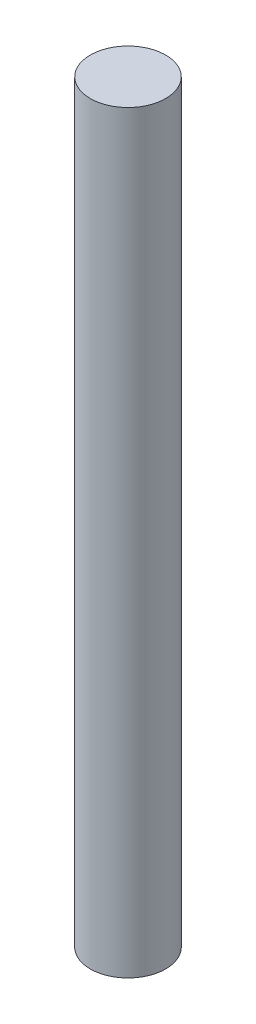
ISO-10303-21;
HEADER;
FILE_DESCRIPTION(('STEP AP214'),'2;1');
FILE_NAME('part.step','',(''),(''),'','','');
FILE_SCHEMA(('AUTOMOTIVE_DESIGN { 1 0 10303 214 1 1 1 1 }'));
ENDSEC;
DATA;
#1=APPLICATION_CONTEXT('core data for automotive mechanical design processes');
#2=APPLICATION_PROTOCOL_DEFINITION('international standard','automotive_design',2000,#1);
#3=PRODUCT_CONTEXT('',#1,'mechanical');
#4=PRODUCT('Part','Part','',(#3));
#5=PRODUCT_RELATED_PRODUCT_CATEGORY('part','',(#4));
#6=PRODUCT_DEFINITION_FORMATION('','',#4);
#7=PRODUCT_DEFINITION_CONTEXT('part definition',#1,'design');
#8=PRODUCT_DEFINITION('design','',#6,#7);
#9=PRODUCT_DEFINITION_SHAPE('','',#8);
#10=(LENGTH_UNIT() NAMED_UNIT(*) SI_UNIT(.MILLI.,.METRE.));
#11=(NAMED_UNIT(*) PLANE_ANGLE_UNIT() SI_UNIT($,.RADIAN.));
#12=(NAMED_UNIT(*) SI_UNIT($,.STERADIAN.) SOLID_ANGLE_UNIT());
#13=UNCERTAINTY_MEASURE_WITH_UNIT(LENGTH_MEASURE(1.E-05),#10,'distance_accuracy_value','');
#14=(GEOMETRIC_REPRESENTATION_CONTEXT(3) GLOBAL_UNCERTAINTY_ASSIGNED_CONTEXT((#13)) GLOBAL_UNIT_ASSIGNED_CONTEXT((#10,
#11,#12)) REPRESENTATION_CONTEXT('',''));
#15=CARTESIAN_POINT('',(0.,0.,0.));
#16=DIRECTION('',(0.,0.,1.));
#17=DIRECTION('',(1.,0.,0.));
#18=AXIS2_PLACEMENT_3D('',#15,#16,#17);
#19=CARTESIAN_POINT('',(0.,1500.,0.));
#20=DIRECTION('',(0.,-1.,0.));
#21=DIRECTION('',(0.,0.,-1.));
#22=AXIS2_PLACEMENT_3D('',#19,#20,#21);
#23=CYLINDRICAL_SURFACE('',#22,75.);
#24=CARTESIAN_POINT('',(0.,1500.,0.));
#25=DIRECTION('',(0.,1.,0.));
#26=DIRECTION('',(0.,0.,1.));
#27=AXIS2_PLACEMENT_3D('',#24,#25,#26);
#28=CIRCLE('',#27,75.);
#29=CARTESIAN_POINT('',(0.,1500.,75.));
#30=VERTEX_POINT('',#29);
#31=EDGE_CURVE('E10',#30,#30,#28,.T.);
#32=ORIENTED_EDGE('',*,*,#31,.F.);
#33=EDGE_LOOP('',(#32));
#34=FACE_BOUND('',#33,.T.);
#35=CARTESIAN_POINT('',(0.,0.,0.));
#36=DIRECTION('',(0.,1.,0.));
#37=DIRECTION('',(0.,0.,1.));
#38=AXIS2_PLACEMENT_3D('',#35,#36,#37);
#39=CIRCLE('',#38,75.);
#40=CARTESIAN_POINT('',(0.,0.,75.));
#41=VERTEX_POINT('',#40);
#42=EDGE_CURVE('E35',#41,#41,#39,.T.);
#43=ORIENTED_EDGE('',*,*,#42,.T.);
#44=EDGE_LOOP('',(#43));
#45=FACE_BOUND('',#44,.T.);
#46=ADVANCED_FACE('F32',(#34,#45),#23,.T.);
#47=CARTESIAN_POINT('',(0.,1500.,0.));
#48=DIRECTION('',(0.,1.,0.));
#49=DIRECTION('',(0.,0.,1.));
#50=AXIS2_PLACEMENT_3D('',#47,#48,#49);
#51=PLANE('',#50);
#52=ORIENTED_EDGE('',*,*,#31,.T.);
#53=EDGE_LOOP('',(#52));
#54=FACE_BOUND('',#53,.T.);
#55=ADVANCED_FACE('F47',(#54),#51,.T.);
#56=CARTESIAN_POINT('',(0.,0.,0.));
#57=DIRECTION('',(0.,1.,0.));
#58=DIRECTION('',(0.,0.,1.));
#59=AXIS2_PLACEMENT_3D('',#56,#57,#58);
#60=PLANE('',#59);
#61=ORIENTED_EDGE('',*,*,#42,.F.);
#62=EDGE_LOOP('',(#61));
#63=FACE_BOUND('',#62,.T.);
#64=ADVANCED_FACE('F45',(#63),#60,.F.);
#65=CLOSED_SHELL('',(#46,#55,#64));
#66=MANIFOLD_SOLID_BREP('B2',#65);
#67=ADVANCED_BREP_SHAPE_REPRESENTATION('',(#18,#66),#14);
#68=SHAPE_DEFINITION_REPRESENTATION(#9,#67);
ENDSEC;
END-ISO-10303-21;
